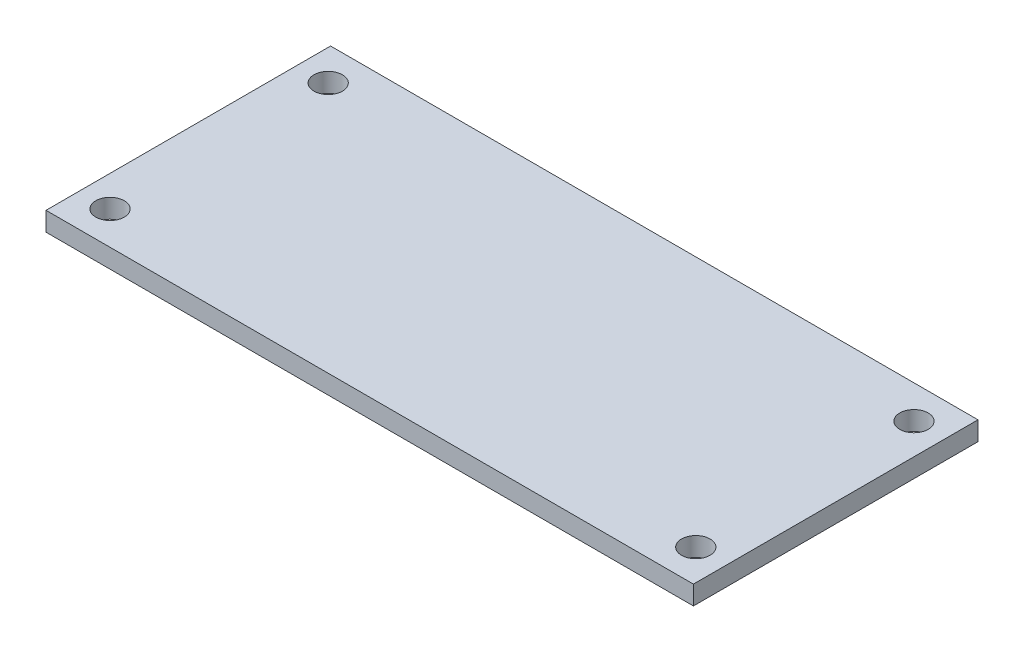
ISO-10303-21;
HEADER;
FILE_DESCRIPTION(('STEP AP214'),'2;1');
FILE_NAME('part.step','',(''),(''),'','','');
FILE_SCHEMA(('AUTOMOTIVE_DESIGN { 1 0 10303 214 1 1 1 1 }'));
ENDSEC;
DATA;
#1=APPLICATION_CONTEXT('core data for automotive mechanical design processes');
#2=APPLICATION_PROTOCOL_DEFINITION('international standard','automotive_design',2000,#1);
#3=PRODUCT_CONTEXT('',#1,'mechanical');
#4=PRODUCT('Part','Part','',(#3));
#5=PRODUCT_RELATED_PRODUCT_CATEGORY('part','',(#4));
#6=PRODUCT_DEFINITION_FORMATION('','',#4);
#7=PRODUCT_DEFINITION_CONTEXT('part definition',#1,'design');
#8=PRODUCT_DEFINITION('design','',#6,#7);
#9=PRODUCT_DEFINITION_SHAPE('','',#8);
#10=(LENGTH_UNIT() NAMED_UNIT(*) SI_UNIT(.MILLI.,.METRE.));
#11=(NAMED_UNIT(*) PLANE_ANGLE_UNIT() SI_UNIT($,.RADIAN.));
#12=(NAMED_UNIT(*) SI_UNIT($,.STERADIAN.) SOLID_ANGLE_UNIT());
#13=UNCERTAINTY_MEASURE_WITH_UNIT(LENGTH_MEASURE(1.E-05),#10,'distance_accuracy_value','');
#14=(GEOMETRIC_REPRESENTATION_CONTEXT(3) GLOBAL_UNCERTAINTY_ASSIGNED_CONTEXT((#13)) GLOBAL_UNIT_ASSIGNED_CONTEXT((#10,
#11,#12)) REPRESENTATION_CONTEXT('',''));
#15=CARTESIAN_POINT('',(0.,0.,0.));
#16=DIRECTION('',(0.,0.,1.));
#17=DIRECTION('',(1.,0.,0.));
#18=AXIS2_PLACEMENT_3D('',#15,#16,#17);
#19=CARTESIAN_POINT('',(0.,2.,0.));
#20=DIRECTION('',(0.,0.,-1.));
#21=DIRECTION('',(-1.,0.,0.));
#22=AXIS2_PLACEMENT_3D('',#19,#20,#21);
#23=PLANE('',#22);
#24=DIRECTION('',(1.,0.,0.));
#25=VECTOR('',#24,1.);
#26=CARTESIAN_POINT('',(0.,0.,0.));
#27=LINE('',#26,#25);
#28=CARTESIAN_POINT('',(0.,0.,0.));
#29=VERTEX_POINT('',#28);
#30=CARTESIAN_POINT('',(68.25,0.,0.));
#31=VERTEX_POINT('',#30);
#32=EDGE_CURVE('E110',#29,#31,#27,.T.);
#33=ORIENTED_EDGE('',*,*,#32,.T.);
#34=DIRECTION('',(0.,-1.,0.));
#35=VECTOR('',#34,1.);
#36=CARTESIAN_POINT('',(68.25,2.,0.));
#37=LINE('',#36,#35);
#38=CARTESIAN_POINT('',(68.25,2.,0.));
#39=VERTEX_POINT('',#38);
#40=EDGE_CURVE('E11',#39,#31,#37,.T.);
#41=ORIENTED_EDGE('',*,*,#40,.F.);
#42=DIRECTION('',(1.,0.,0.));
#43=VECTOR('',#42,1.);
#44=CARTESIAN_POINT('',(0.,2.,0.));
#45=LINE('',#44,#43);
#46=CARTESIAN_POINT('',(0.,2.,0.));
#47=VERTEX_POINT('',#46);
#48=EDGE_CURVE('E84',#47,#39,#45,.T.);
#49=ORIENTED_EDGE('',*,*,#48,.F.);
#50=DIRECTION('',(0.,-1.,0.));
#51=VECTOR('',#50,1.);
#52=CARTESIAN_POINT('',(0.,2.,0.));
#53=LINE('',#52,#51);
#54=EDGE_CURVE('E51',#47,#29,#53,.T.);
#55=ORIENTED_EDGE('',*,*,#54,.T.);
#56=EDGE_LOOP('',(#33,#41,#49,#55));
#57=FACE_BOUND('',#56,.T.);
#58=ADVANCED_FACE('F34',(#57),#23,.F.);
#59=CARTESIAN_POINT('',(68.25,2.,0.));
#60=DIRECTION('',(-1.,0.,0.));
#61=DIRECTION('',(0.,0.,1.));
#62=AXIS2_PLACEMENT_3D('',#59,#60,#61);
#63=PLANE('',#62);
#64=DIRECTION('',(0.,0.,-1.));
#65=VECTOR('',#64,1.);
#66=CARTESIAN_POINT('',(68.25,0.,0.));
#67=LINE('',#66,#65);
#68=CARTESIAN_POINT('',(68.25,0.,-30.));
#69=VERTEX_POINT('',#68);
#70=EDGE_CURVE('E89',#31,#69,#67,.T.);
#71=ORIENTED_EDGE('',*,*,#70,.T.);
#72=DIRECTION('',(0.,-1.,0.));
#73=VECTOR('',#72,1.);
#74=CARTESIAN_POINT('',(68.25,2.,-30.));
#75=LINE('',#74,#73);
#76=CARTESIAN_POINT('',(68.25,2.,-30.));
#77=VERTEX_POINT('',#76);
#78=EDGE_CURVE('E43',#77,#69,#75,.T.);
#79=ORIENTED_EDGE('',*,*,#78,.F.);
#80=DIRECTION('',(0.,0.,-1.));
#81=VECTOR('',#80,1.);
#82=CARTESIAN_POINT('',(68.25,2.,0.));
#83=LINE('',#82,#81);
#84=EDGE_CURVE('E76',#39,#77,#83,.T.);
#85=ORIENTED_EDGE('',*,*,#84,.F.);
#86=ORIENTED_EDGE('',*,*,#40,.T.);
#87=EDGE_LOOP('',(#71,#79,#85,#86));
#88=FACE_BOUND('',#87,.T.);
#89=ADVANCED_FACE('F88',(#88),#63,.F.);
#90=CARTESIAN_POINT('',(0.,2.,-30.));
#91=DIRECTION('',(0.,0.,-1.));
#92=DIRECTION('',(-1.,0.,0.));
#93=AXIS2_PLACEMENT_3D('',#90,#91,#92);
#94=PLANE('',#93);
#95=DIRECTION('',(1.,0.,0.));
#96=VECTOR('',#95,1.);
#97=CARTESIAN_POINT('',(0.,0.,-30.));
#98=LINE('',#97,#96);
#99=CARTESIAN_POINT('',(0.,0.,-30.));
#100=VERTEX_POINT('',#99);
#101=EDGE_CURVE('E113',#100,#69,#98,.T.);
#102=ORIENTED_EDGE('',*,*,#101,.F.);
#103=DIRECTION('',(0.,-1.,0.));
#104=VECTOR('',#103,1.);
#105=CARTESIAN_POINT('',(0.,2.,-30.));
#106=LINE('',#105,#104);
#107=CARTESIAN_POINT('',(0.,2.,-30.));
#108=VERTEX_POINT('',#107);
#109=EDGE_CURVE('E65',#108,#100,#106,.T.);
#110=ORIENTED_EDGE('',*,*,#109,.F.);
#111=DIRECTION('',(1.,0.,0.));
#112=VECTOR('',#111,1.);
#113=CARTESIAN_POINT('',(0.,2.,-30.));
#114=LINE('',#113,#112);
#115=EDGE_CURVE('E83',#108,#77,#114,.T.);
#116=ORIENTED_EDGE('',*,*,#115,.T.);
#117=ORIENTED_EDGE('',*,*,#78,.T.);
#118=EDGE_LOOP('',(#102,#110,#116,#117));
#119=FACE_BOUND('',#118,.T.);
#120=ADVANCED_FACE('F92',(#119),#94,.T.);
#121=CARTESIAN_POINT('',(3.25,2.,-26.5));
#122=DIRECTION('',(0.,-1.,0.));
#123=DIRECTION('',(0.,0.,-1.));
#124=AXIS2_PLACEMENT_3D('',#121,#122,#123);
#125=CYLINDRICAL_SURFACE('',#124,1.5);
#126=CARTESIAN_POINT('',(3.25,2.,-26.5));
#127=DIRECTION('',(0.,1.,0.));
#128=DIRECTION('',(0.,0.,1.));
#129=AXIS2_PLACEMENT_3D('',#126,#127,#128);
#130=CIRCLE('',#129,1.5);
#131=CARTESIAN_POINT('',(3.25,2.,-25.));
#132=VERTEX_POINT('',#131);
#133=EDGE_CURVE('E132',#132,#132,#130,.T.);
#134=ORIENTED_EDGE('',*,*,#133,.T.);
#135=EDGE_LOOP('',(#134));
#136=FACE_BOUND('',#135,.T.);
#137=CARTESIAN_POINT('',(3.25,0.,-26.5));
#138=DIRECTION('',(0.,1.,0.));
#139=DIRECTION('',(0.,0.,1.));
#140=AXIS2_PLACEMENT_3D('',#137,#138,#139);
#141=CIRCLE('',#140,1.5);
#142=CARTESIAN_POINT('',(3.25,0.,-25.));
#143=VERTEX_POINT('',#142);
#144=EDGE_CURVE('E107',#143,#143,#141,.T.);
#145=ORIENTED_EDGE('',*,*,#144,.F.);
#146=EDGE_LOOP('',(#145));
#147=FACE_BOUND('',#146,.T.);
#148=ADVANCED_FACE('F136',(#136,#147),#125,.F.);
#149=CARTESIAN_POINT('',(65.,2.,-3.5));
#150=DIRECTION('',(0.,-1.,0.));
#151=DIRECTION('',(0.,0.,-1.));
#152=AXIS2_PLACEMENT_3D('',#149,#150,#151);
#153=CYLINDRICAL_SURFACE('',#152,1.5);
#154=CARTESIAN_POINT('',(65.,2.,-3.5));
#155=DIRECTION('',(0.,1.,0.));
#156=DIRECTION('',(0.,0.,1.));
#157=AXIS2_PLACEMENT_3D('',#154,#155,#156);
#158=CIRCLE('',#157,1.5);
#159=CARTESIAN_POINT('',(65.,2.,-2.));
#160=VERTEX_POINT('',#159);
#161=EDGE_CURVE('E127',#160,#160,#158,.T.);
#162=ORIENTED_EDGE('',*,*,#161,.T.);
#163=EDGE_LOOP('',(#162));
#164=FACE_BOUND('',#163,.T.);
#165=CARTESIAN_POINT('',(65.,0.,-3.5));
#166=DIRECTION('',(0.,1.,0.));
#167=DIRECTION('',(0.,0.,1.));
#168=AXIS2_PLACEMENT_3D('',#165,#166,#167);
#169=CIRCLE('',#168,1.5);
#170=CARTESIAN_POINT('',(65.,0.,-2.));
#171=VERTEX_POINT('',#170);
#172=EDGE_CURVE('E104',#171,#171,#169,.T.);
#173=ORIENTED_EDGE('',*,*,#172,.F.);
#174=EDGE_LOOP('',(#173));
#175=FACE_BOUND('',#174,.T.);
#176=ADVANCED_FACE('F162',(#164,#175),#153,.F.);
#177=CARTESIAN_POINT('',(65.,2.,-26.5));
#178=DIRECTION('',(0.,-1.,0.));
#179=DIRECTION('',(0.,0.,-1.));
#180=AXIS2_PLACEMENT_3D('',#177,#178,#179);
#181=CYLINDRICAL_SURFACE('',#180,1.49999999999998);
#182=CARTESIAN_POINT('',(65.,2.,-26.5));
#183=DIRECTION('',(0.,1.,0.));
#184=DIRECTION('',(0.,0.,1.));
#185=AXIS2_PLACEMENT_3D('',#182,#183,#184);
#186=CIRCLE('',#185,1.49999999999998);
#187=CARTESIAN_POINT('',(65.,2.,-25.));
#188=VERTEX_POINT('',#187);
#189=EDGE_CURVE('E122',#188,#188,#186,.T.);
#190=ORIENTED_EDGE('',*,*,#189,.T.);
#191=EDGE_LOOP('',(#190));
#192=FACE_BOUND('',#191,.T.);
#193=CARTESIAN_POINT('',(65.,0.,-26.5));
#194=DIRECTION('',(0.,1.,0.));
#195=DIRECTION('',(0.,0.,1.));
#196=AXIS2_PLACEMENT_3D('',#193,#194,#195);
#197=CIRCLE('',#196,1.49999999999998);
#198=CARTESIAN_POINT('',(65.,0.,-25.));
#199=VERTEX_POINT('',#198);
#200=EDGE_CURVE('E101',#199,#199,#197,.T.);
#201=ORIENTED_EDGE('',*,*,#200,.F.);
#202=EDGE_LOOP('',(#201));
#203=FACE_BOUND('',#202,.T.);
#204=ADVANCED_FACE('F164',(#192,#203),#181,.F.);
#205=CARTESIAN_POINT('',(3.25,2.,-3.49999999999999));
#206=DIRECTION('',(0.,-1.,0.));
#207=DIRECTION('',(0.,0.,-1.));
#208=AXIS2_PLACEMENT_3D('',#205,#206,#207);
#209=CYLINDRICAL_SURFACE('',#208,1.5);
#210=CARTESIAN_POINT('',(3.25,2.,-3.49999999999999));
#211=DIRECTION('',(0.,1.,0.));
#212=DIRECTION('',(0.,0.,1.));
#213=AXIS2_PLACEMENT_3D('',#210,#211,#212);
#214=CIRCLE('',#213,1.5);
#215=CARTESIAN_POINT('',(3.25,2.,-1.99999999999999));
#216=VERTEX_POINT('',#215);
#217=EDGE_CURVE('E118',#216,#216,#214,.T.);
#218=ORIENTED_EDGE('',*,*,#217,.T.);
#219=EDGE_LOOP('',(#218));
#220=FACE_BOUND('',#219,.T.);
#221=CARTESIAN_POINT('',(3.25,0.,-3.49999999999999));
#222=DIRECTION('',(0.,1.,0.));
#223=DIRECTION('',(0.,0.,1.));
#224=AXIS2_PLACEMENT_3D('',#221,#222,#223);
#225=CIRCLE('',#224,1.5);
#226=CARTESIAN_POINT('',(3.25,0.,-1.99999999999999));
#227=VERTEX_POINT('',#226);
#228=EDGE_CURVE('E98',#227,#227,#225,.T.);
#229=ORIENTED_EDGE('',*,*,#228,.F.);
#230=EDGE_LOOP('',(#229));
#231=FACE_BOUND('',#230,.T.);
#232=ADVANCED_FACE('F36',(#220,#231),#209,.F.);
#233=CARTESIAN_POINT('',(0.,2.,0.));
#234=DIRECTION('',(-1.,0.,0.));
#235=DIRECTION('',(0.,0.,1.));
#236=AXIS2_PLACEMENT_3D('',#233,#234,#235);
#237=PLANE('',#236);
#238=DIRECTION('',(0.,0.,-1.));
#239=VECTOR('',#238,1.);
#240=CARTESIAN_POINT('',(0.,0.,0.));
#241=LINE('',#240,#239);
#242=EDGE_CURVE('E115',#29,#100,#241,.T.);
#243=ORIENTED_EDGE('',*,*,#242,.F.);
#244=ORIENTED_EDGE('',*,*,#54,.F.);
#245=DIRECTION('',(0.,0.,-1.));
#246=VECTOR('',#245,1.);
#247=CARTESIAN_POINT('',(0.,2.,0.));
#248=LINE('',#247,#246);
#249=EDGE_CURVE('E93',#47,#108,#248,.T.);
#250=ORIENTED_EDGE('',*,*,#249,.T.);
#251=ORIENTED_EDGE('',*,*,#109,.T.);
#252=EDGE_LOOP('',(#243,#244,#250,#251));
#253=FACE_BOUND('',#252,.T.);
#254=ADVANCED_FACE('F141',(#253),#237,.T.);
#255=CARTESIAN_POINT('',(0.,2.,0.));
#256=DIRECTION('',(0.,1.,0.));
#257=DIRECTION('',(0.,0.,1.));
#258=AXIS2_PLACEMENT_3D('',#255,#256,#257);
#259=PLANE('',#258);
#260=ORIENTED_EDGE('',*,*,#217,.F.);
#261=EDGE_LOOP('',(#260));
#262=FACE_BOUND('',#261,.T.);
#263=ORIENTED_EDGE('',*,*,#189,.F.);
#264=EDGE_LOOP('',(#263));
#265=FACE_BOUND('',#264,.T.);
#266=ORIENTED_EDGE('',*,*,#161,.F.);
#267=EDGE_LOOP('',(#266));
#268=FACE_BOUND('',#267,.T.);
#269=ORIENTED_EDGE('',*,*,#133,.F.);
#270=EDGE_LOOP('',(#269));
#271=FACE_BOUND('',#270,.T.);
#272=ORIENTED_EDGE('',*,*,#48,.T.);
#273=ORIENTED_EDGE('',*,*,#84,.T.);
#274=ORIENTED_EDGE('',*,*,#115,.F.);
#275=ORIENTED_EDGE('',*,*,#249,.F.);
#276=EDGE_LOOP('',(#272,#273,#274,#275));
#277=FACE_BOUND('',#276,.T.);
#278=ADVANCED_FACE('F80',(#262,#265,#268,#271,#277),#259,.T.);
#279=CARTESIAN_POINT('',(0.,0.,0.));
#280=DIRECTION('',(0.,1.,0.));
#281=DIRECTION('',(0.,0.,1.));
#282=AXIS2_PLACEMENT_3D('',#279,#280,#281);
#283=PLANE('',#282);
#284=ORIENTED_EDGE('',*,*,#228,.T.);
#285=EDGE_LOOP('',(#284));
#286=FACE_BOUND('',#285,.T.);
#287=ORIENTED_EDGE('',*,*,#200,.T.);
#288=EDGE_LOOP('',(#287));
#289=FACE_BOUND('',#288,.T.);
#290=ORIENTED_EDGE('',*,*,#172,.T.);
#291=EDGE_LOOP('',(#290));
#292=FACE_BOUND('',#291,.T.);
#293=ORIENTED_EDGE('',*,*,#144,.T.);
#294=EDGE_LOOP('',(#293));
#295=FACE_BOUND('',#294,.T.);
#296=ORIENTED_EDGE('',*,*,#32,.F.);
#297=ORIENTED_EDGE('',*,*,#242,.T.);
#298=ORIENTED_EDGE('',*,*,#101,.T.);
#299=ORIENTED_EDGE('',*,*,#70,.F.);
#300=EDGE_LOOP('',(#296,#297,#298,#299));
#301=FACE_BOUND('',#300,.T.);
#302=ADVANCED_FACE('F140',(#286,#289,#292,#295,#301),#283,.F.);
#303=CLOSED_SHELL('',(#58,#89,#120,#148,#176,#204,#232,#254,#278,#302));
#304=MANIFOLD_SOLID_BREP('B2',#303);
#305=ADVANCED_BREP_SHAPE_REPRESENTATION('',(#18,#304),#14);
#306=SHAPE_DEFINITION_REPRESENTATION(#9,#305);
ENDSEC;
END-ISO-10303-21;
